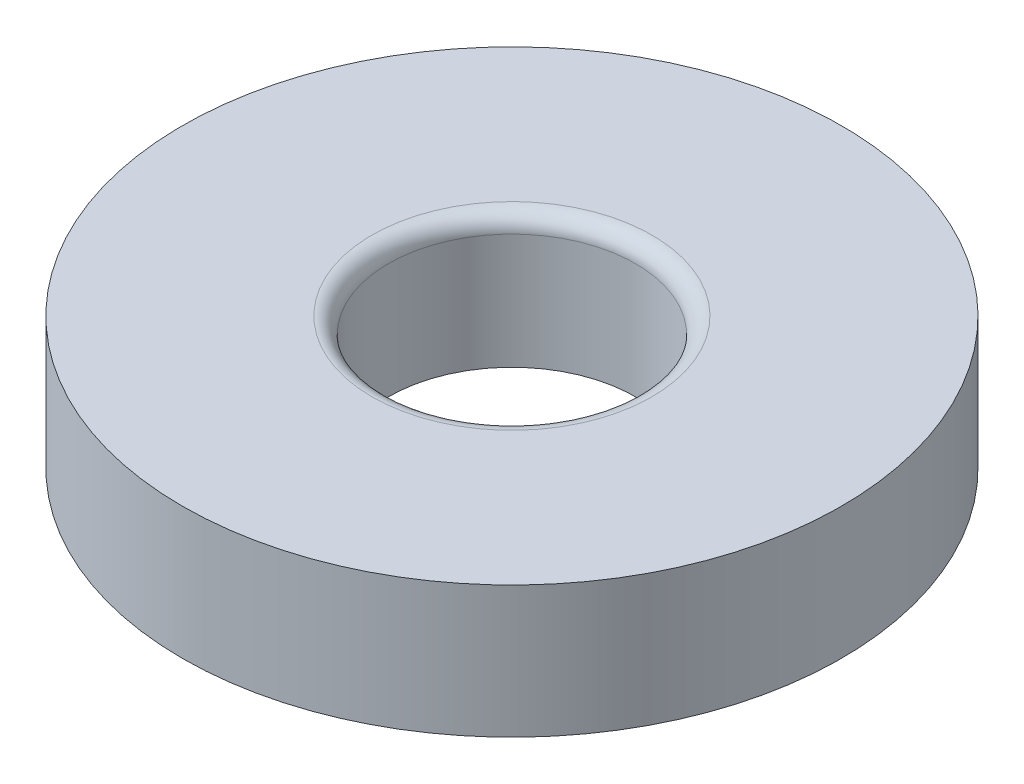
ISO-10303-21;
HEADER;
FILE_DESCRIPTION(('STEP AP214'),'2;1');
FILE_NAME('part.step','',(''),(''),'','','');
FILE_SCHEMA(('AUTOMOTIVE_DESIGN { 1 0 10303 214 1 1 1 1 }'));
ENDSEC;
DATA;
#1=APPLICATION_CONTEXT('core data for automotive mechanical design processes');
#2=APPLICATION_PROTOCOL_DEFINITION('international standard','automotive_design',2000,#1);
#3=PRODUCT_CONTEXT('',#1,'mechanical');
#4=PRODUCT('Part','Part','',(#3));
#5=PRODUCT_RELATED_PRODUCT_CATEGORY('part','',(#4));
#6=PRODUCT_DEFINITION_FORMATION('','',#4);
#7=PRODUCT_DEFINITION_CONTEXT('part definition',#1,'design');
#8=PRODUCT_DEFINITION('design','',#6,#7);
#9=PRODUCT_DEFINITION_SHAPE('','',#8);
#10=(LENGTH_UNIT() NAMED_UNIT(*) SI_UNIT(.MILLI.,.METRE.));
#11=(NAMED_UNIT(*) PLANE_ANGLE_UNIT() SI_UNIT($,.RADIAN.));
#12=(NAMED_UNIT(*) SI_UNIT($,.STERADIAN.) SOLID_ANGLE_UNIT());
#13=UNCERTAINTY_MEASURE_WITH_UNIT(LENGTH_MEASURE(1.E-05),#10,'distance_accuracy_value','');
#14=(GEOMETRIC_REPRESENTATION_CONTEXT(3) GLOBAL_UNCERTAINTY_ASSIGNED_CONTEXT((#13)) GLOBAL_UNIT_ASSIGNED_CONTEXT((#10,
#11,#12)) REPRESENTATION_CONTEXT('',''));
#15=CARTESIAN_POINT('',(0.,0.,0.));
#16=DIRECTION('',(0.,0.,1.));
#17=DIRECTION('',(1.,0.,0.));
#18=AXIS2_PLACEMENT_3D('',#15,#16,#17);
#19=CARTESIAN_POINT('',(0.,8.,0.));
#20=DIRECTION('',(0.,-1.,0.));
#21=DIRECTION('',(0.,0.,-1.));
#22=AXIS2_PLACEMENT_3D('',#19,#20,#21);
#23=CYLINDRICAL_SURFACE('',#22,20.);
#24=CARTESIAN_POINT('',(0.,8.,0.));
#25=DIRECTION('',(0.,1.,0.));
#26=DIRECTION('',(0.,0.,1.));
#27=AXIS2_PLACEMENT_3D('',#24,#25,#26);
#28=CIRCLE('',#27,20.);
#29=CARTESIAN_POINT('',(0.,8.,20.));
#30=VERTEX_POINT('',#29);
#31=EDGE_CURVE('E44',#30,#30,#28,.T.);
#32=ORIENTED_EDGE('',*,*,#31,.F.);
#33=EDGE_LOOP('',(#32));
#34=FACE_BOUND('',#33,.T.);
#35=CARTESIAN_POINT('',(0.,0.,0.));
#36=DIRECTION('',(0.,1.,0.));
#37=DIRECTION('',(0.,0.,1.));
#38=AXIS2_PLACEMENT_3D('',#35,#36,#37);
#39=CIRCLE('',#38,20.);
#40=CARTESIAN_POINT('',(0.,0.,20.));
#41=VERTEX_POINT('',#40);
#42=EDGE_CURVE('E48',#41,#41,#39,.T.);
#43=ORIENTED_EDGE('',*,*,#42,.T.);
#44=EDGE_LOOP('',(#43));
#45=FACE_BOUND('',#44,.T.);
#46=ADVANCED_FACE('F33',(#34,#45),#23,.T.);
#47=CARTESIAN_POINT('',(0.,8.,0.));
#48=DIRECTION('',(0.,1.,0.));
#49=DIRECTION('',(0.,0.,1.));
#50=AXIS2_PLACEMENT_3D('',#47,#48,#49);
#51=PLANE('',#50);
#52=CARTESIAN_POINT('',(0.,8.,0.));
#53=DIRECTION('',(0.,1.,0.));
#54=DIRECTION('',(0.,0.,1.));
#55=AXIS2_PLACEMENT_3D('',#52,#53,#54);
#56=CIRCLE('',#55,8.5);
#57=CARTESIAN_POINT('',(0.,8.,8.5));
#58=VERTEX_POINT('',#57);
#59=EDGE_CURVE('E10',#58,#58,#56,.F.);
#60=ORIENTED_EDGE('',*,*,#59,.T.);
#61=EDGE_LOOP('',(#60));
#62=FACE_BOUND('',#61,.T.);
#63=ORIENTED_EDGE('',*,*,#31,.T.);
#64=EDGE_LOOP('',(#63));
#65=FACE_BOUND('',#64,.T.);
#66=ADVANCED_FACE('F68',(#62,#65),#51,.T.);
#67=CARTESIAN_POINT('',(0.,0.,0.));
#68=DIRECTION('',(0.,1.,0.));
#69=DIRECTION('',(0.,0.,1.));
#70=AXIS2_PLACEMENT_3D('',#67,#68,#69);
#71=PLANE('',#70);
#72=CARTESIAN_POINT('',(0.,0.,0.));
#73=DIRECTION('',(0.,1.,0.));
#74=DIRECTION('',(0.,0.,1.));
#75=AXIS2_PLACEMENT_3D('',#72,#73,#74);
#76=CIRCLE('',#75,7.5);
#77=CARTESIAN_POINT('',(0.,0.,7.5));
#78=VERTEX_POINT('',#77);
#79=EDGE_CURVE('E52',#78,#78,#76,.T.);
#80=ORIENTED_EDGE('',*,*,#79,.T.);
#81=EDGE_LOOP('',(#80));
#82=FACE_BOUND('',#81,.T.);
#83=ORIENTED_EDGE('',*,*,#42,.F.);
#84=EDGE_LOOP('',(#83));
#85=FACE_BOUND('',#84,.T.);
#86=ADVANCED_FACE('F57',(#82,#85),#71,.F.);
#87=CARTESIAN_POINT('',(0.,0.,0.));
#88=DIRECTION('',(0.,1.,0.));
#89=DIRECTION('',(0.,0.,1.));
#90=AXIS2_PLACEMENT_3D('',#87,#88,#89);
#91=CYLINDRICAL_SURFACE('',#90,7.5);
#92=CARTESIAN_POINT('',(0.,7.,0.));
#93=DIRECTION('',(0.,1.,0.));
#94=DIRECTION('',(0.,0.,1.));
#95=AXIS2_PLACEMENT_3D('',#92,#93,#94);
#96=CIRCLE('',#95,7.5);
#97=CARTESIAN_POINT('',(0.,7.,7.5));
#98=VERTEX_POINT('',#97);
#99=EDGE_CURVE('E40',#98,#98,#96,.T.);
#100=ORIENTED_EDGE('',*,*,#99,.T.);
#101=EDGE_LOOP('',(#100));
#102=FACE_BOUND('',#101,.T.);
#103=ORIENTED_EDGE('',*,*,#79,.F.);
#104=EDGE_LOOP('',(#103));
#105=FACE_BOUND('',#104,.T.);
#106=ADVANCED_FACE('F60',(#102,#105),#91,.F.);
#107=CARTESIAN_POINT('',(0.,7.,0.));
#108=DIRECTION('',(0.,1.,0.));
#109=DIRECTION('',(0.,0.,1.));
#110=AXIS2_PLACEMENT_3D('',#107,#108,#109);
#111=TOROIDAL_SURFACE('',#110,8.5,1.);
#112=ORIENTED_EDGE('',*,*,#59,.F.);
#113=EDGE_LOOP('',(#112));
#114=FACE_BOUND('',#113,.T.);
#115=ORIENTED_EDGE('',*,*,#99,.F.);
#116=EDGE_LOOP('',(#115));
#117=FACE_BOUND('',#116,.T.);
#118=ADVANCED_FACE('F35',(#114,#117),#111,.T.);
#119=CLOSED_SHELL('',(#46,#66,#86,#106,#118));
#120=MANIFOLD_SOLID_BREP('B2',#119);
#121=ADVANCED_BREP_SHAPE_REPRESENTATION('',(#18,#120),#14);
#122=SHAPE_DEFINITION_REPRESENTATION(#9,#121);
ENDSEC;
END-ISO-10303-21;
